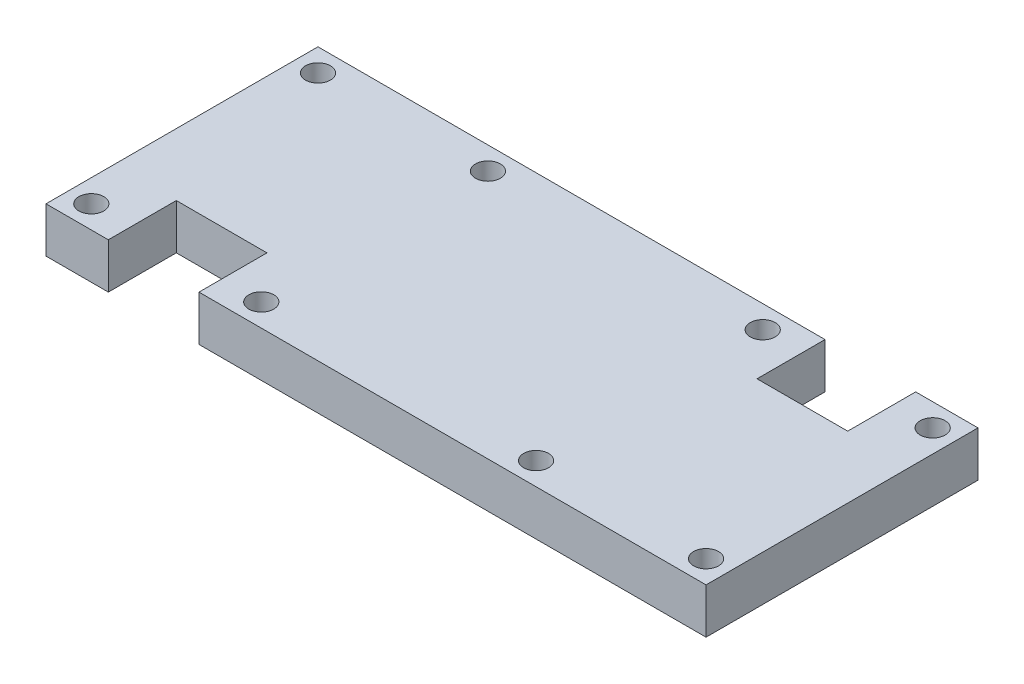
ISO-10303-21;
HEADER;
FILE_DESCRIPTION(('STEP AP214'),'2;1');
FILE_NAME('part.step','',(''),(''),'','','');
FILE_SCHEMA(('AUTOMOTIVE_DESIGN { 1 0 10303 214 1 1 1 1 }'));
ENDSEC;
DATA;
#1=APPLICATION_CONTEXT('core data for automotive mechanical design processes');
#2=APPLICATION_PROTOCOL_DEFINITION('international standard','automotive_design',2000,#1);
#3=PRODUCT_CONTEXT('',#1,'mechanical');
#4=PRODUCT('Part','Part','',(#3));
#5=PRODUCT_RELATED_PRODUCT_CATEGORY('part','',(#4));
#6=PRODUCT_DEFINITION_FORMATION('','',#4);
#7=PRODUCT_DEFINITION_CONTEXT('part definition',#1,'design');
#8=PRODUCT_DEFINITION('design','',#6,#7);
#9=PRODUCT_DEFINITION_SHAPE('','',#8);
#10=(LENGTH_UNIT() NAMED_UNIT(*) SI_UNIT(.MILLI.,.METRE.));
#11=(NAMED_UNIT(*) PLANE_ANGLE_UNIT() SI_UNIT($,.RADIAN.));
#12=(NAMED_UNIT(*) SI_UNIT($,.STERADIAN.) SOLID_ANGLE_UNIT());
#13=UNCERTAINTY_MEASURE_WITH_UNIT(LENGTH_MEASURE(1.E-05),#10,'distance_accuracy_value','');
#14=(GEOMETRIC_REPRESENTATION_CONTEXT(3) GLOBAL_UNCERTAINTY_ASSIGNED_CONTEXT((#13)) GLOBAL_UNIT_ASSIGNED_CONTEXT((#10,
#11,#12)) REPRESENTATION_CONTEXT('',''));
#15=CARTESIAN_POINT('',(0.,0.,0.));
#16=DIRECTION('',(0.,0.,1.));
#17=DIRECTION('',(1.,0.,0.));
#18=AXIS2_PLACEMENT_3D('',#15,#16,#17);
#19=CARTESIAN_POINT('',(116.5,8.,0.));
#20=DIRECTION('',(0.,0.,-1.));
#21=DIRECTION('',(-1.,0.,0.));
#22=AXIS2_PLACEMENT_3D('',#19,#20,#21);
#23=PLANE('',#22);
#24=DIRECTION('',(1.,0.,0.));
#25=VECTOR('',#24,1.);
#26=CARTESIAN_POINT('',(116.5,0.,0.));
#27=LINE('',#26,#25);
#28=CARTESIAN_POINT('',(0.,0.,0.));
#29=VERTEX_POINT('',#28);
#30=CARTESIAN_POINT('',(11.,0.,0.));
#31=VERTEX_POINT('',#30);
#32=EDGE_CURVE('E137',#29,#31,#27,.T.);
#33=ORIENTED_EDGE('',*,*,#32,.T.);
#34=DIRECTION('',(0.,1.,0.));
#35=VECTOR('',#34,1.);
#36=CARTESIAN_POINT('',(11.,0.,0.));
#37=LINE('',#36,#35);
#38=CARTESIAN_POINT('',(11.,8.,0.));
#39=VERTEX_POINT('',#38);
#40=EDGE_CURVE('E123',#31,#39,#37,.T.);
#41=ORIENTED_EDGE('',*,*,#40,.T.);
#42=DIRECTION('',(1.,0.,0.));
#43=VECTOR('',#42,1.);
#44=CARTESIAN_POINT('',(0.,8.,0.));
#45=LINE('',#44,#43);
#46=CARTESIAN_POINT('',(0.,8.,0.));
#47=VERTEX_POINT('',#46);
#48=EDGE_CURVE('E189',#47,#39,#45,.T.);
#49=ORIENTED_EDGE('',*,*,#48,.F.);
#50=DIRECTION('',(0.,-1.,0.));
#51=VECTOR('',#50,1.);
#52=CARTESIAN_POINT('',(0.,8.,0.));
#53=LINE('',#52,#51);
#54=EDGE_CURVE('E11',#47,#29,#53,.T.);
#55=ORIENTED_EDGE('',*,*,#54,.T.);
#56=EDGE_LOOP('',(#33,#41,#49,#55));
#57=FACE_BOUND('',#56,.T.);
#58=ADVANCED_FACE('F34',(#57),#23,.F.);
#59=CARTESIAN_POINT('',(38.,8.,-48.));
#60=DIRECTION('',(0.,0.,1.));
#61=DIRECTION('',(1.,0.,0.));
#62=AXIS2_PLACEMENT_3D('',#59,#60,#61);
#63=PLANE('',#62);
#64=DIRECTION('',(-1.,0.,0.));
#65=VECTOR('',#64,1.);
#66=CARTESIAN_POINT('',(38.,0.,-48.));
#67=LINE('',#66,#65);
#68=CARTESIAN_POINT('',(116.5,0.,-48.));
#69=VERTEX_POINT('',#68);
#70=CARTESIAN_POINT('',(105.5,0.,-47.9999999999997));
#71=VERTEX_POINT('',#70);
#72=EDGE_CURVE('E154',#69,#71,#67,.T.);
#73=ORIENTED_EDGE('',*,*,#72,.T.);
#74=DIRECTION('',(0.,1.,0.));
#75=VECTOR('',#74,1.);
#76=CARTESIAN_POINT('',(105.5,0.,-47.9999999999997));
#77=LINE('',#76,#75);
#78=CARTESIAN_POINT('',(105.5,8.,-47.9999999999997));
#79=VERTEX_POINT('',#78);
#80=EDGE_CURVE('E182',#71,#79,#77,.T.);
#81=ORIENTED_EDGE('',*,*,#80,.T.);
#82=DIRECTION('',(-1.,0.,0.));
#83=VECTOR('',#82,1.);
#84=CARTESIAN_POINT('',(78.5,8.,-48.));
#85=LINE('',#84,#83);
#86=CARTESIAN_POINT('',(116.5,8.,-48.));
#87=VERTEX_POINT('',#86);
#88=EDGE_CURVE('E162',#87,#79,#85,.T.);
#89=ORIENTED_EDGE('',*,*,#88,.F.);
#90=DIRECTION('',(0.,-1.,0.));
#91=VECTOR('',#90,1.);
#92=CARTESIAN_POINT('',(116.5,8.,-48.));
#93=LINE('',#92,#91);
#94=EDGE_CURVE('E161',#87,#69,#93,.T.);
#95=ORIENTED_EDGE('',*,*,#94,.T.);
#96=EDGE_LOOP('',(#73,#81,#89,#95));
#97=FACE_BOUND('',#96,.T.);
#98=ADVANCED_FACE('F180',(#97),#63,.F.);
#99=CARTESIAN_POINT('',(0.,8.,-48.));
#100=DIRECTION('',(1.,0.,0.));
#101=DIRECTION('',(0.,0.,-1.));
#102=AXIS2_PLACEMENT_3D('',#99,#100,#101);
#103=PLANE('',#102);
#104=DIRECTION('',(0.,0.,1.));
#105=VECTOR('',#104,1.);
#106=CARTESIAN_POINT('',(0.,0.,-48.));
#107=LINE('',#106,#105);
#108=CARTESIAN_POINT('',(0.,0.,-48.));
#109=VERTEX_POINT('',#108);
#110=EDGE_CURVE('E150',#109,#29,#107,.T.);
#111=ORIENTED_EDGE('',*,*,#110,.T.);
#112=ORIENTED_EDGE('',*,*,#54,.F.);
#113=DIRECTION('',(0.,0.,1.));
#114=VECTOR('',#113,1.);
#115=CARTESIAN_POINT('',(0.,8.,-48.));
#116=LINE('',#115,#114);
#117=CARTESIAN_POINT('',(0.,8.,-48.));
#118=VERTEX_POINT('',#117);
#119=EDGE_CURVE('E157',#118,#47,#116,.T.);
#120=ORIENTED_EDGE('',*,*,#119,.F.);
#121=DIRECTION('',(0.,-1.,0.));
#122=VECTOR('',#121,1.);
#123=CARTESIAN_POINT('',(0.,8.,-48.));
#124=LINE('',#123,#122);
#125=EDGE_CURVE('E158',#118,#109,#124,.T.);
#126=ORIENTED_EDGE('',*,*,#125,.T.);
#127=EDGE_LOOP('',(#111,#112,#120,#126));
#128=FACE_BOUND('',#127,.T.);
#129=ADVANCED_FACE('F36',(#128),#103,.F.);
#130=CARTESIAN_POINT('',(27.,8.,0.));
#131=VERTEX_POINT('',#130);
#132=CARTESIAN_POINT('',(116.5,8.,0.));
#133=VERTEX_POINT('',#132);
#134=EDGE_CURVE('E191',#131,#133,#45,.T.);
#135=ORIENTED_EDGE('',*,*,#134,.F.);
#136=DIRECTION('',(0.,1.,0.));
#137=VECTOR('',#136,1.);
#138=CARTESIAN_POINT('',(27.,0.,0.));
#139=LINE('',#138,#137);
#140=CARTESIAN_POINT('',(27.,0.,0.));
#141=VERTEX_POINT('',#140);
#142=EDGE_CURVE('E132',#141,#131,#139,.T.);
#143=ORIENTED_EDGE('',*,*,#142,.F.);
#144=CARTESIAN_POINT('',(116.5,0.,0.));
#145=VERTEX_POINT('',#144);
#146=EDGE_CURVE('E145',#141,#145,#27,.T.);
#147=ORIENTED_EDGE('',*,*,#146,.T.);
#148=DIRECTION('',(0.,-1.,0.));
#149=VECTOR('',#148,1.);
#150=CARTESIAN_POINT('',(116.5,8.,0.));
#151=LINE('',#150,#149);
#152=EDGE_CURVE('E42',#133,#145,#151,.T.);
#153=ORIENTED_EDGE('',*,*,#152,.F.);
#154=EDGE_LOOP('',(#135,#143,#147,#153));
#155=FACE_BOUND('',#154,.T.);
#156=ADVANCED_FACE('F278',(#155),#23,.F.);
#157=CARTESIAN_POINT('',(116.5,8.,-48.));
#158=DIRECTION('',(-1.,0.,0.));
#159=DIRECTION('',(0.,0.,1.));
#160=AXIS2_PLACEMENT_3D('',#157,#158,#159);
#161=PLANE('',#160);
#162=DIRECTION('',(0.,0.,-1.));
#163=VECTOR('',#162,1.);
#164=CARTESIAN_POINT('',(116.5,0.,-48.));
#165=LINE('',#164,#163);
#166=EDGE_CURVE('E144',#145,#69,#165,.T.);
#167=ORIENTED_EDGE('',*,*,#166,.T.);
#168=ORIENTED_EDGE('',*,*,#94,.F.);
#169=DIRECTION('',(0.,0.,-1.));
#170=VECTOR('',#169,1.);
#171=CARTESIAN_POINT('',(116.5,8.,-48.));
#172=LINE('',#171,#170);
#173=EDGE_CURVE('E171',#133,#87,#172,.T.);
#174=ORIENTED_EDGE('',*,*,#173,.F.);
#175=ORIENTED_EDGE('',*,*,#152,.T.);
#176=EDGE_LOOP('',(#167,#168,#174,#175));
#177=FACE_BOUND('',#176,.T.);
#178=ADVANCED_FACE('F169',(#177),#161,.F.);
#179=CARTESIAN_POINT('',(89.5000000000002,8.,-47.9999999999998));
#180=VERTEX_POINT('',#179);
#181=EDGE_CURVE('E186',#180,#118,#85,.T.);
#182=ORIENTED_EDGE('',*,*,#181,.F.);
#183=DIRECTION('',(0.,1.,0.));
#184=VECTOR('',#183,1.);
#185=CARTESIAN_POINT('',(89.5000000000002,0.,-47.9999999999998));
#186=LINE('',#185,#184);
#187=CARTESIAN_POINT('',(89.5000000000002,0.,-47.9999999999998));
#188=VERTEX_POINT('',#187);
#189=EDGE_CURVE('E243',#188,#180,#186,.T.);
#190=ORIENTED_EDGE('',*,*,#189,.F.);
#191=EDGE_CURVE('E148',#188,#109,#67,.T.);
#192=ORIENTED_EDGE('',*,*,#191,.T.);
#193=ORIENTED_EDGE('',*,*,#125,.F.);
#194=EDGE_LOOP('',(#182,#190,#192,#193));
#195=FACE_BOUND('',#194,.T.);
#196=ADVANCED_FACE('F297',(#195),#63,.F.);
#197=CARTESIAN_POINT('',(0.,8.,0.));
#198=DIRECTION('',(0.,1.,0.));
#199=DIRECTION('',(0.,0.,1.));
#200=AXIS2_PLACEMENT_3D('',#197,#198,#199);
#201=PLANE('',#200);
#202=DIRECTION('',(0.,0.,1.));
#203=VECTOR('',#202,1.);
#204=CARTESIAN_POINT('',(11.,8.,0.));
#205=LINE('',#204,#203);
#206=CARTESIAN_POINT('',(11.,8.,-12.));
#207=VERTEX_POINT('',#206);
#208=EDGE_CURVE('E128',#207,#39,#205,.T.);
#209=ORIENTED_EDGE('',*,*,#208,.F.);
#210=DIRECTION('',(-1.,0.,0.));
#211=VECTOR('',#210,1.);
#212=CARTESIAN_POINT('',(11.,8.,-12.));
#213=LINE('',#212,#211);
#214=CARTESIAN_POINT('',(27.,8.,-12.));
#215=VERTEX_POINT('',#214);
#216=EDGE_CURVE('E140',#215,#207,#213,.T.);
#217=ORIENTED_EDGE('',*,*,#216,.F.);
#218=DIRECTION('',(0.,0.,-1.));
#219=VECTOR('',#218,1.);
#220=CARTESIAN_POINT('',(27.,8.,0.));
#221=LINE('',#220,#219);
#222=EDGE_CURVE('E269',#131,#215,#221,.T.);
#223=ORIENTED_EDGE('',*,*,#222,.F.);
#224=ORIENTED_EDGE('',*,*,#134,.T.);
#225=ORIENTED_EDGE('',*,*,#173,.T.);
#226=ORIENTED_EDGE('',*,*,#88,.T.);
#227=DIRECTION('',(0.,0.,-1.));
#228=VECTOR('',#227,1.);
#229=CARTESIAN_POINT('',(105.5,8.,-47.9999999999997));
#230=LINE('',#229,#228);
#231=CARTESIAN_POINT('',(105.5,8.,-35.9999999999997));
#232=VERTEX_POINT('',#231);
#233=EDGE_CURVE('E250',#232,#79,#230,.T.);
#234=ORIENTED_EDGE('',*,*,#233,.F.);
#235=DIRECTION('',(1.,0.,0.));
#236=VECTOR('',#235,1.);
#237=CARTESIAN_POINT('',(105.5,8.,-35.9999999999997));
#238=LINE('',#237,#236);
#239=CARTESIAN_POINT('',(89.5000000000001,8.,-35.9999999999998));
#240=VERTEX_POINT('',#239);
#241=EDGE_CURVE('E253',#240,#232,#238,.T.);
#242=ORIENTED_EDGE('',*,*,#241,.F.);
#243=DIRECTION('',(0.,0.,1.));
#244=VECTOR('',#243,1.);
#245=CARTESIAN_POINT('',(89.5000000000002,8.,-47.9999999999998));
#246=LINE('',#245,#244);
#247=EDGE_CURVE('E256',#180,#240,#246,.T.);
#248=ORIENTED_EDGE('',*,*,#247,.F.);
#249=ORIENTED_EDGE('',*,*,#181,.T.);
#250=ORIENTED_EDGE('',*,*,#119,.T.);
#251=ORIENTED_EDGE('',*,*,#48,.T.);
#252=EDGE_LOOP('',(#209,#217,#223,#224,#225,#226,#234,#242,#248,#249,#250,#251));
#253=FACE_BOUND('',#252,.T.);
#254=CARTESIAN_POINT('',(112.5,8.,-44.));
#255=DIRECTION('',(0.,-1.,0.));
#256=DIRECTION('',(0.,0.,1.));
#257=AXIS2_PLACEMENT_3D('',#254,#255,#256);
#258=CIRCLE('',#257,2.20000000000001);
#259=CARTESIAN_POINT('',(112.5,8.,-41.8));
#260=VERTEX_POINT('',#259);
#261=EDGE_CURVE('E216',#260,#260,#258,.T.);
#262=ORIENTED_EDGE('',*,*,#261,.T.);
#263=EDGE_LOOP('',(#262));
#264=FACE_BOUND('',#263,.T.);
#265=CARTESIAN_POINT('',(4.,8.,-44.));
#266=DIRECTION('',(0.,-1.,0.));
#267=DIRECTION('',(0.,0.,-1.));
#268=AXIS2_PLACEMENT_3D('',#265,#266,#267);
#269=CIRCLE('',#268,2.2);
#270=CARTESIAN_POINT('',(4.,8.,-46.2));
#271=VERTEX_POINT('',#270);
#272=EDGE_CURVE('E205',#271,#271,#269,.T.);
#273=ORIENTED_EDGE('',*,*,#272,.T.);
#274=EDGE_LOOP('',(#273));
#275=FACE_BOUND('',#274,.T.);
#276=CARTESIAN_POINT('',(34.,8.,-44.));
#277=DIRECTION('',(0.,-1.,0.));
#278=DIRECTION('',(0.,0.,-1.));
#279=AXIS2_PLACEMENT_3D('',#276,#277,#278);
#280=CIRCLE('',#279,2.2);
#281=CARTESIAN_POINT('',(34.,8.,-46.2));
#282=VERTEX_POINT('',#281);
#283=EDGE_CURVE('E204',#282,#282,#280,.T.);
#284=ORIENTED_EDGE('',*,*,#283,.T.);
#285=EDGE_LOOP('',(#284));
#286=FACE_BOUND('',#285,.T.);
#287=CARTESIAN_POINT('',(34.,8.,-4.));
#288=DIRECTION('',(0.,-1.,0.));
#289=DIRECTION('',(0.,0.,-1.));
#290=AXIS2_PLACEMENT_3D('',#287,#288,#289);
#291=CIRCLE('',#290,2.2);
#292=CARTESIAN_POINT('',(34.,8.,-6.2));
#293=VERTEX_POINT('',#292);
#294=EDGE_CURVE('E198',#293,#293,#291,.T.);
#295=ORIENTED_EDGE('',*,*,#294,.T.);
#296=EDGE_LOOP('',(#295));
#297=FACE_BOUND('',#296,.T.);
#298=CARTESIAN_POINT('',(82.5,8.,-44.));
#299=DIRECTION('',(0.,-1.,0.));
#300=DIRECTION('',(0.,0.,1.));
#301=AXIS2_PLACEMENT_3D('',#298,#299,#300);
#302=CIRCLE('',#301,2.20000000000001);
#303=CARTESIAN_POINT('',(82.5,8.,-41.8));
#304=VERTEX_POINT('',#303);
#305=EDGE_CURVE('E217',#304,#304,#302,.T.);
#306=ORIENTED_EDGE('',*,*,#305,.T.);
#307=EDGE_LOOP('',(#306));
#308=FACE_BOUND('',#307,.T.);
#309=CARTESIAN_POINT('',(82.5,8.,-3.99999999999999));
#310=DIRECTION('',(0.,-1.,0.));
#311=DIRECTION('',(0.,0.,1.));
#312=AXIS2_PLACEMENT_3D('',#309,#310,#311);
#313=CIRCLE('',#312,2.2);
#314=CARTESIAN_POINT('',(82.5,8.,-1.8));
#315=VERTEX_POINT('',#314);
#316=EDGE_CURVE('E235',#315,#315,#313,.T.);
#317=ORIENTED_EDGE('',*,*,#316,.T.);
#318=EDGE_LOOP('',(#317));
#319=FACE_BOUND('',#318,.T.);
#320=CARTESIAN_POINT('',(112.5,8.,-3.99999999999999));
#321=DIRECTION('',(0.,-1.,0.));
#322=DIRECTION('',(0.,0.,1.));
#323=AXIS2_PLACEMENT_3D('',#320,#321,#322);
#324=CIRCLE('',#323,2.20000000000001);
#325=CARTESIAN_POINT('',(112.5,8.,-1.79999999999997));
#326=VERTEX_POINT('',#325);
#327=EDGE_CURVE('E228',#326,#326,#324,.T.);
#328=ORIENTED_EDGE('',*,*,#327,.T.);
#329=EDGE_LOOP('',(#328));
#330=FACE_BOUND('',#329,.T.);
#331=CARTESIAN_POINT('',(4.,8.,-4.));
#332=DIRECTION('',(0.,-1.,0.));
#333=DIRECTION('',(0.,0.,-1.));
#334=AXIS2_PLACEMENT_3D('',#331,#332,#333);
#335=CIRCLE('',#334,2.2);
#336=CARTESIAN_POINT('',(4.,8.,-6.2));
#337=VERTEX_POINT('',#336);
#338=EDGE_CURVE('E197',#337,#337,#335,.T.);
#339=ORIENTED_EDGE('',*,*,#338,.T.);
#340=EDGE_LOOP('',(#339));
#341=FACE_BOUND('',#340,.T.);
#342=ADVANCED_FACE('F279',(#253,#264,#275,#286,#297,#308,#319,#330,#341),#201,.T.);
#343=CARTESIAN_POINT('',(0.,0.,0.));
#344=DIRECTION('',(0.,1.,0.));
#345=DIRECTION('',(0.,0.,1.));
#346=AXIS2_PLACEMENT_3D('',#343,#344,#345);
#347=PLANE('',#346);
#348=CARTESIAN_POINT('',(112.5,0.,-44.));
#349=DIRECTION('',(0.,-1.,0.));
#350=DIRECTION('',(0.,0.,1.));
#351=AXIS2_PLACEMENT_3D('',#348,#349,#350);
#352=CIRCLE('',#351,2.20000000000001);
#353=CARTESIAN_POINT('',(112.5,0.,-41.8));
#354=VERTEX_POINT('',#353);
#355=EDGE_CURVE('E213',#354,#354,#352,.T.);
#356=ORIENTED_EDGE('',*,*,#355,.F.);
#357=EDGE_LOOP('',(#356));
#358=FACE_BOUND('',#357,.T.);
#359=CARTESIAN_POINT('',(4.,0.,-44.));
#360=DIRECTION('',(0.,-1.,0.));
#361=DIRECTION('',(0.,0.,-1.));
#362=AXIS2_PLACEMENT_3D('',#359,#360,#361);
#363=CIRCLE('',#362,2.2);
#364=CARTESIAN_POINT('',(4.,0.,-46.2));
#365=VERTEX_POINT('',#364);
#366=EDGE_CURVE('E220',#365,#365,#363,.T.);
#367=ORIENTED_EDGE('',*,*,#366,.F.);
#368=EDGE_LOOP('',(#367));
#369=FACE_BOUND('',#368,.T.);
#370=CARTESIAN_POINT('',(34.,0.,-44.));
#371=DIRECTION('',(0.,-1.,0.));
#372=DIRECTION('',(0.,0.,-1.));
#373=AXIS2_PLACEMENT_3D('',#370,#371,#372);
#374=CIRCLE('',#373,2.2);
#375=CARTESIAN_POINT('',(34.,0.,-46.2));
#376=VERTEX_POINT('',#375);
#377=EDGE_CURVE('E201',#376,#376,#374,.T.);
#378=ORIENTED_EDGE('',*,*,#377,.F.);
#379=EDGE_LOOP('',(#378));
#380=FACE_BOUND('',#379,.T.);
#381=CARTESIAN_POINT('',(34.,0.,-4.));
#382=DIRECTION('',(0.,-1.,0.));
#383=DIRECTION('',(0.,0.,-1.));
#384=AXIS2_PLACEMENT_3D('',#381,#382,#383);
#385=CIRCLE('',#384,2.2);
#386=CARTESIAN_POINT('',(34.,0.,-6.2));
#387=VERTEX_POINT('',#386);
#388=EDGE_CURVE('E208',#387,#387,#385,.T.);
#389=ORIENTED_EDGE('',*,*,#388,.F.);
#390=EDGE_LOOP('',(#389));
#391=FACE_BOUND('',#390,.T.);
#392=CARTESIAN_POINT('',(82.5,0.,-44.));
#393=DIRECTION('',(0.,-1.,0.));
#394=DIRECTION('',(0.,0.,1.));
#395=AXIS2_PLACEMENT_3D('',#392,#393,#394);
#396=CIRCLE('',#395,2.20000000000001);
#397=CARTESIAN_POINT('',(82.5,0.,-41.8));
#398=VERTEX_POINT('',#397);
#399=EDGE_CURVE('E238',#398,#398,#396,.T.);
#400=ORIENTED_EDGE('',*,*,#399,.F.);
#401=EDGE_LOOP('',(#400));
#402=FACE_BOUND('',#401,.T.);
#403=CARTESIAN_POINT('',(82.5,0.,-3.99999999999999));
#404=DIRECTION('',(0.,-1.,0.));
#405=DIRECTION('',(0.,0.,1.));
#406=AXIS2_PLACEMENT_3D('',#403,#404,#405);
#407=CIRCLE('',#406,2.2);
#408=CARTESIAN_POINT('',(82.5,0.,-1.8));
#409=VERTEX_POINT('',#408);
#410=EDGE_CURVE('E232',#409,#409,#407,.T.);
#411=ORIENTED_EDGE('',*,*,#410,.F.);
#412=EDGE_LOOP('',(#411));
#413=FACE_BOUND('',#412,.T.);
#414=CARTESIAN_POINT('',(112.5,0.,-3.99999999999999));
#415=DIRECTION('',(0.,-1.,0.));
#416=DIRECTION('',(0.,0.,1.));
#417=AXIS2_PLACEMENT_3D('',#414,#415,#416);
#418=CIRCLE('',#417,2.20000000000001);
#419=CARTESIAN_POINT('',(112.5,0.,-1.79999999999997));
#420=VERTEX_POINT('',#419);
#421=EDGE_CURVE('E225',#420,#420,#418,.T.);
#422=ORIENTED_EDGE('',*,*,#421,.F.);
#423=EDGE_LOOP('',(#422));
#424=FACE_BOUND('',#423,.T.);
#425=CARTESIAN_POINT('',(4.,0.,-4.));
#426=DIRECTION('',(0.,-1.,0.));
#427=DIRECTION('',(0.,0.,-1.));
#428=AXIS2_PLACEMENT_3D('',#425,#426,#427);
#429=CIRCLE('',#428,2.2);
#430=CARTESIAN_POINT('',(4.,0.,-6.2));
#431=VERTEX_POINT('',#430);
#432=EDGE_CURVE('E194',#431,#431,#429,.T.);
#433=ORIENTED_EDGE('',*,*,#432,.F.);
#434=EDGE_LOOP('',(#433));
#435=FACE_BOUND('',#434,.T.);
#436=DIRECTION('',(-1.,0.,0.));
#437=VECTOR('',#436,1.);
#438=CARTESIAN_POINT('',(11.,0.,-12.));
#439=LINE('',#438,#437);
#440=CARTESIAN_POINT('',(27.,0.,-12.));
#441=VERTEX_POINT('',#440);
#442=CARTESIAN_POINT('',(11.,0.,-12.));
#443=VERTEX_POINT('',#442);
#444=EDGE_CURVE('E49',#441,#443,#439,.T.);
#445=ORIENTED_EDGE('',*,*,#444,.T.);
#446=DIRECTION('',(0.,0.,1.));
#447=VECTOR('',#446,1.);
#448=CARTESIAN_POINT('',(11.,0.,0.));
#449=LINE('',#448,#447);
#450=EDGE_CURVE('E126',#443,#31,#449,.T.);
#451=ORIENTED_EDGE('',*,*,#450,.T.);
#452=ORIENTED_EDGE('',*,*,#32,.F.);
#453=ORIENTED_EDGE('',*,*,#110,.F.);
#454=ORIENTED_EDGE('',*,*,#191,.F.);
#455=DIRECTION('',(0.,0.,1.));
#456=VECTOR('',#455,1.);
#457=CARTESIAN_POINT('',(89.5000000000002,0.,-47.9999999999998));
#458=LINE('',#457,#456);
#459=CARTESIAN_POINT('',(89.5000000000001,0.,-35.9999999999998));
#460=VERTEX_POINT('',#459);
#461=EDGE_CURVE('E252',#188,#460,#458,.T.);
#462=ORIENTED_EDGE('',*,*,#461,.T.);
#463=DIRECTION('',(1.,0.,0.));
#464=VECTOR('',#463,1.);
#465=CARTESIAN_POINT('',(105.5,0.,-35.9999999999997));
#466=LINE('',#465,#464);
#467=CARTESIAN_POINT('',(105.5,0.,-35.9999999999997));
#468=VERTEX_POINT('',#467);
#469=EDGE_CURVE('E57',#460,#468,#466,.T.);
#470=ORIENTED_EDGE('',*,*,#469,.T.);
#471=DIRECTION('',(0.,0.,-1.));
#472=VECTOR('',#471,1.);
#473=CARTESIAN_POINT('',(105.5,0.,-47.9999999999997));
#474=LINE('',#473,#472);
#475=EDGE_CURVE('E177',#468,#71,#474,.T.);
#476=ORIENTED_EDGE('',*,*,#475,.T.);
#477=ORIENTED_EDGE('',*,*,#72,.F.);
#478=ORIENTED_EDGE('',*,*,#166,.F.);
#479=ORIENTED_EDGE('',*,*,#146,.F.);
#480=DIRECTION('',(0.,0.,-1.));
#481=VECTOR('',#480,1.);
#482=CARTESIAN_POINT('',(27.,0.,0.));
#483=LINE('',#482,#481);
#484=EDGE_CURVE('E139',#141,#441,#483,.T.);
#485=ORIENTED_EDGE('',*,*,#484,.T.);
#486=EDGE_LOOP('',(#445,#451,#452,#453,#454,#462,#470,#476,#477,#478,#479,#485));
#487=FACE_BOUND('',#486,.T.);
#488=ADVANCED_FACE('F135',(#358,#369,#380,#391,#402,#413,#424,#435,#487),#347,.F.);
#489=CARTESIAN_POINT('',(4.,8.,-4.));
#490=DIRECTION('',(0.,-1.,0.));
#491=DIRECTION('',(0.,0.,-1.));
#492=AXIS2_PLACEMENT_3D('',#489,#490,#491);
#493=CYLINDRICAL_SURFACE('',#492,2.2);
#494=ORIENTED_EDGE('',*,*,#338,.F.);
#495=EDGE_LOOP('',(#494));
#496=FACE_BOUND('',#495,.T.);
#497=ORIENTED_EDGE('',*,*,#432,.T.);
#498=EDGE_LOOP('',(#497));
#499=FACE_BOUND('',#498,.T.);
#500=ADVANCED_FACE('F345',(#496,#499),#493,.F.);
#501=CARTESIAN_POINT('',(112.5,8.,-3.99999999999999));
#502=DIRECTION('',(0.,-1.,0.));
#503=DIRECTION('',(0.,0.,-1.));
#504=AXIS2_PLACEMENT_3D('',#501,#502,#503);
#505=CYLINDRICAL_SURFACE('',#504,2.20000000000001);
#506=ORIENTED_EDGE('',*,*,#327,.F.);
#507=EDGE_LOOP('',(#506));
#508=FACE_BOUND('',#507,.T.);
#509=ORIENTED_EDGE('',*,*,#421,.T.);
#510=EDGE_LOOP('',(#509));
#511=FACE_BOUND('',#510,.T.);
#512=ADVANCED_FACE('F341',(#508,#511),#505,.F.);
#513=CARTESIAN_POINT('',(82.5,8.,-3.99999999999999));
#514=DIRECTION('',(0.,-1.,0.));
#515=DIRECTION('',(0.,0.,-1.));
#516=AXIS2_PLACEMENT_3D('',#513,#514,#515);
#517=CYLINDRICAL_SURFACE('',#516,2.2);
#518=ORIENTED_EDGE('',*,*,#316,.F.);
#519=EDGE_LOOP('',(#518));
#520=FACE_BOUND('',#519,.T.);
#521=ORIENTED_EDGE('',*,*,#410,.T.);
#522=EDGE_LOOP('',(#521));
#523=FACE_BOUND('',#522,.T.);
#524=ADVANCED_FACE('F337',(#520,#523),#517,.F.);
#525=CARTESIAN_POINT('',(82.5,8.,-44.));
#526=DIRECTION('',(0.,-1.,0.));
#527=DIRECTION('',(0.,0.,-1.));
#528=AXIS2_PLACEMENT_3D('',#525,#526,#527);
#529=CYLINDRICAL_SURFACE('',#528,2.20000000000001);
#530=ORIENTED_EDGE('',*,*,#305,.F.);
#531=EDGE_LOOP('',(#530));
#532=FACE_BOUND('',#531,.T.);
#533=ORIENTED_EDGE('',*,*,#399,.T.);
#534=EDGE_LOOP('',(#533));
#535=FACE_BOUND('',#534,.T.);
#536=ADVANCED_FACE('F333',(#532,#535),#529,.F.);
#537=CARTESIAN_POINT('',(34.,8.,-4.));
#538=DIRECTION('',(0.,-1.,0.));
#539=DIRECTION('',(0.,0.,-1.));
#540=AXIS2_PLACEMENT_3D('',#537,#538,#539);
#541=CYLINDRICAL_SURFACE('',#540,2.2);
#542=ORIENTED_EDGE('',*,*,#294,.F.);
#543=EDGE_LOOP('',(#542));
#544=FACE_BOUND('',#543,.T.);
#545=ORIENTED_EDGE('',*,*,#388,.T.);
#546=EDGE_LOOP('',(#545));
#547=FACE_BOUND('',#546,.T.);
#548=ADVANCED_FACE('F336',(#544,#547),#541,.F.);
#549=CARTESIAN_POINT('',(34.,8.,-44.));
#550=DIRECTION('',(0.,-1.,0.));
#551=DIRECTION('',(0.,0.,-1.));
#552=AXIS2_PLACEMENT_3D('',#549,#550,#551);
#553=CYLINDRICAL_SURFACE('',#552,2.2);
#554=ORIENTED_EDGE('',*,*,#283,.F.);
#555=EDGE_LOOP('',(#554));
#556=FACE_BOUND('',#555,.T.);
#557=ORIENTED_EDGE('',*,*,#377,.T.);
#558=EDGE_LOOP('',(#557));
#559=FACE_BOUND('',#558,.T.);
#560=ADVANCED_FACE('F348',(#556,#559),#553,.F.);
#561=CARTESIAN_POINT('',(4.,8.,-44.));
#562=DIRECTION('',(0.,-1.,0.));
#563=DIRECTION('',(0.,0.,-1.));
#564=AXIS2_PLACEMENT_3D('',#561,#562,#563);
#565=CYLINDRICAL_SURFACE('',#564,2.2);
#566=ORIENTED_EDGE('',*,*,#272,.F.);
#567=EDGE_LOOP('',(#566));
#568=FACE_BOUND('',#567,.T.);
#569=ORIENTED_EDGE('',*,*,#366,.T.);
#570=EDGE_LOOP('',(#569));
#571=FACE_BOUND('',#570,.T.);
#572=ADVANCED_FACE('F327',(#568,#571),#565,.F.);
#573=CARTESIAN_POINT('',(112.5,8.,-44.));
#574=DIRECTION('',(0.,-1.,0.));
#575=DIRECTION('',(0.,0.,-1.));
#576=AXIS2_PLACEMENT_3D('',#573,#574,#575);
#577=CYLINDRICAL_SURFACE('',#576,2.20000000000001);
#578=ORIENTED_EDGE('',*,*,#261,.F.);
#579=EDGE_LOOP('',(#578));
#580=FACE_BOUND('',#579,.T.);
#581=ORIENTED_EDGE('',*,*,#355,.T.);
#582=EDGE_LOOP('',(#581));
#583=FACE_BOUND('',#582,.T.);
#584=ADVANCED_FACE('F320',(#580,#583),#577,.F.);
#585=CARTESIAN_POINT('',(105.5,0.,-47.9999999999997));
#586=DIRECTION('',(1.,0.,0.));
#587=DIRECTION('',(0.,0.,-1.));
#588=AXIS2_PLACEMENT_3D('',#585,#586,#587);
#589=PLANE('',#588);
#590=ORIENTED_EDGE('',*,*,#233,.T.);
#591=ORIENTED_EDGE('',*,*,#80,.F.);
#592=ORIENTED_EDGE('',*,*,#475,.F.);
#593=DIRECTION('',(0.,1.,0.));
#594=VECTOR('',#593,1.);
#595=CARTESIAN_POINT('',(105.5,0.,-35.9999999999997));
#596=LINE('',#595,#594);
#597=EDGE_CURVE('E247',#468,#232,#596,.T.);
#598=ORIENTED_EDGE('',*,*,#597,.T.);
#599=EDGE_LOOP('',(#590,#591,#592,#598));
#600=FACE_BOUND('',#599,.T.);
#601=ADVANCED_FACE('F318',(#600),#589,.F.);
#602=CARTESIAN_POINT('',(105.5,0.,-35.9999999999997));
#603=DIRECTION('',(0.,0.,1.));
#604=DIRECTION('',(1.,0.,0.));
#605=AXIS2_PLACEMENT_3D('',#602,#603,#604);
#606=PLANE('',#605);
#607=ORIENTED_EDGE('',*,*,#241,.T.);
#608=ORIENTED_EDGE('',*,*,#597,.F.);
#609=ORIENTED_EDGE('',*,*,#469,.F.);
#610=DIRECTION('',(0.,1.,0.));
#611=VECTOR('',#610,1.);
#612=CARTESIAN_POINT('',(89.5000000000001,0.,-35.9999999999998));
#613=LINE('',#612,#611);
#614=EDGE_CURVE('E245',#460,#240,#613,.T.);
#615=ORIENTED_EDGE('',*,*,#614,.T.);
#616=EDGE_LOOP('',(#607,#608,#609,#615));
#617=FACE_BOUND('',#616,.T.);
#618=ADVANCED_FACE('F316',(#617),#606,.F.);
#619=CARTESIAN_POINT('',(89.5000000000002,0.,-47.9999999999998));
#620=DIRECTION('',(-1.,0.,0.));
#621=DIRECTION('',(0.,0.,1.));
#622=AXIS2_PLACEMENT_3D('',#619,#620,#621);
#623=PLANE('',#622);
#624=ORIENTED_EDGE('',*,*,#247,.T.);
#625=ORIENTED_EDGE('',*,*,#614,.F.);
#626=ORIENTED_EDGE('',*,*,#461,.F.);
#627=ORIENTED_EDGE('',*,*,#189,.T.);
#628=EDGE_LOOP('',(#624,#625,#626,#627));
#629=FACE_BOUND('',#628,.T.);
#630=ADVANCED_FACE('F290',(#629),#623,.F.);
#631=CARTESIAN_POINT('',(11.,0.,0.));
#632=DIRECTION('',(-1.,0.,0.));
#633=DIRECTION('',(0.,0.,1.));
#634=AXIS2_PLACEMENT_3D('',#631,#632,#633);
#635=PLANE('',#634);
#636=ORIENTED_EDGE('',*,*,#208,.T.);
#637=ORIENTED_EDGE('',*,*,#40,.F.);
#638=ORIENTED_EDGE('',*,*,#450,.F.);
#639=DIRECTION('',(0.,1.,0.));
#640=VECTOR('',#639,1.);
#641=CARTESIAN_POINT('',(11.,0.,-12.));
#642=LINE('',#641,#640);
#643=EDGE_CURVE('E229',#443,#207,#642,.T.);
#644=ORIENTED_EDGE('',*,*,#643,.T.);
#645=EDGE_LOOP('',(#636,#637,#638,#644));
#646=FACE_BOUND('',#645,.T.);
#647=ADVANCED_FACE('F125',(#646),#635,.F.);
#648=CARTESIAN_POINT('',(11.,0.,-12.));
#649=DIRECTION('',(0.,0.,-1.));
#650=DIRECTION('',(-1.,0.,0.));
#651=AXIS2_PLACEMENT_3D('',#648,#649,#650);
#652=PLANE('',#651);
#653=ORIENTED_EDGE('',*,*,#216,.T.);
#654=ORIENTED_EDGE('',*,*,#643,.F.);
#655=ORIENTED_EDGE('',*,*,#444,.F.);
#656=DIRECTION('',(0.,1.,0.));
#657=VECTOR('',#656,1.);
#658=CARTESIAN_POINT('',(27.,0.,-12.));
#659=LINE('',#658,#657);
#660=EDGE_CURVE('E264',#441,#215,#659,.T.);
#661=ORIENTED_EDGE('',*,*,#660,.T.);
#662=EDGE_LOOP('',(#653,#654,#655,#661));
#663=FACE_BOUND('',#662,.T.);
#664=ADVANCED_FACE('F282',(#663),#652,.F.);
#665=CARTESIAN_POINT('',(27.,0.,0.));
#666=DIRECTION('',(1.,0.,0.));
#667=DIRECTION('',(0.,0.,-1.));
#668=AXIS2_PLACEMENT_3D('',#665,#666,#667);
#669=PLANE('',#668);
#670=ORIENTED_EDGE('',*,*,#222,.T.);
#671=ORIENTED_EDGE('',*,*,#660,.F.);
#672=ORIENTED_EDGE('',*,*,#484,.F.);
#673=ORIENTED_EDGE('',*,*,#142,.T.);
#674=EDGE_LOOP('',(#670,#671,#672,#673));
#675=FACE_BOUND('',#674,.T.);
#676=ADVANCED_FACE('F276',(#675),#669,.F.);
#677=CLOSED_SHELL('',(#58,#98,#129,#156,#178,#196,#342,#488,#500,#512,#524,#536,#548,#560,#572,
#584,#601,#618,#630,#647,#664,#676));
#678=MANIFOLD_SOLID_BREP('B2',#677);
#679=ADVANCED_BREP_SHAPE_REPRESENTATION('',(#18,#678),#14);
#680=SHAPE_DEFINITION_REPRESENTATION(#9,#679);
ENDSEC;
END-ISO-10303-21;
